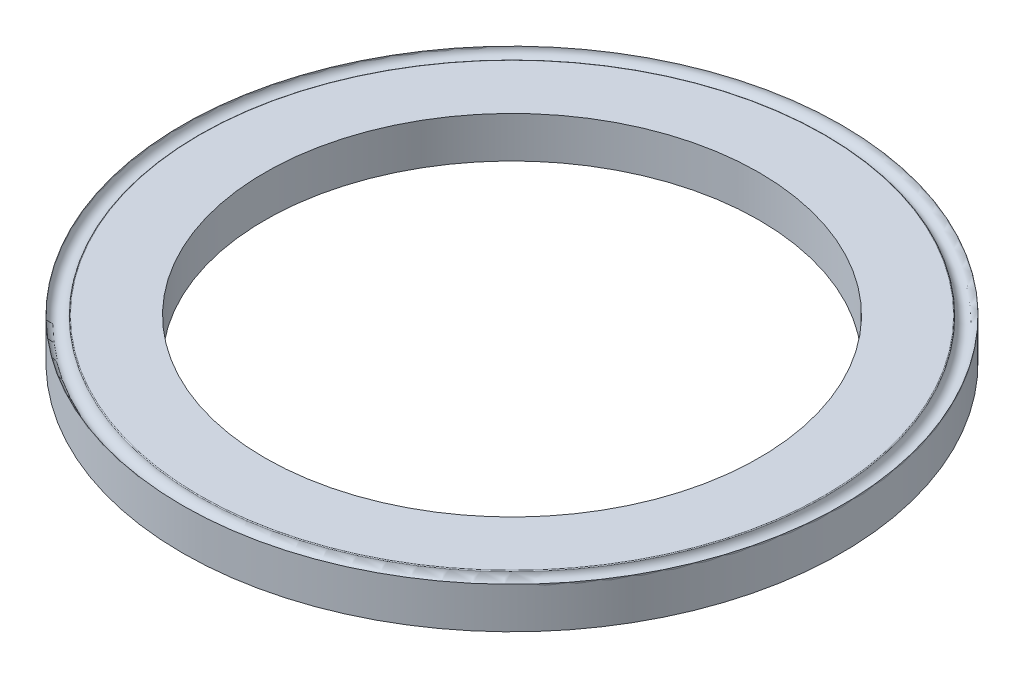
ISO-10303-21;
HEADER;
FILE_DESCRIPTION(('STEP AP214'),'2;1');
FILE_NAME('part.step','',(''),(''),'','','');
FILE_SCHEMA(('AUTOMOTIVE_DESIGN { 1 0 10303 214 1 1 1 1 }'));
ENDSEC;
DATA;
#1=APPLICATION_CONTEXT('core data for automotive mechanical design processes');
#2=APPLICATION_PROTOCOL_DEFINITION('international standard','automotive_design',2000,#1);
#3=PRODUCT_CONTEXT('',#1,'mechanical');
#4=PRODUCT('Part','Part','',(#3));
#5=PRODUCT_RELATED_PRODUCT_CATEGORY('part','',(#4));
#6=PRODUCT_DEFINITION_FORMATION('','',#4);
#7=PRODUCT_DEFINITION_CONTEXT('part definition',#1,'design');
#8=PRODUCT_DEFINITION('design','',#6,#7);
#9=PRODUCT_DEFINITION_SHAPE('','',#8);
#10=(LENGTH_UNIT() NAMED_UNIT(*) SI_UNIT(.MILLI.,.METRE.));
#11=(NAMED_UNIT(*) PLANE_ANGLE_UNIT() SI_UNIT($,.RADIAN.));
#12=(NAMED_UNIT(*) SI_UNIT($,.STERADIAN.) SOLID_ANGLE_UNIT());
#13=UNCERTAINTY_MEASURE_WITH_UNIT(LENGTH_MEASURE(1.E-05),#10,'distance_accuracy_value','');
#14=(GEOMETRIC_REPRESENTATION_CONTEXT(3) GLOBAL_UNCERTAINTY_ASSIGNED_CONTEXT((#13)) GLOBAL_UNIT_ASSIGNED_CONTEXT((#10,
#11,#12)) REPRESENTATION_CONTEXT('',''));
#15=CARTESIAN_POINT('',(0.,0.,0.));
#16=DIRECTION('',(0.,0.,1.));
#17=DIRECTION('',(1.,0.,0.));
#18=AXIS2_PLACEMENT_3D('',#15,#16,#17);
#19=CARTESIAN_POINT('',(0.,0.25,0.));
#20=DIRECTION('',(0.,1.,0.));
#21=DIRECTION('',(0.,0.,1.));
#22=AXIS2_PLACEMENT_3D('',#19,#20,#21);
#23=PLANE('',#22);
#24=CARTESIAN_POINT('',(0.,0.25,0.));
#25=DIRECTION('',(0.,1.,0.));
#26=DIRECTION('',(0.,0.,1.));
#27=AXIS2_PLACEMENT_3D('',#24,#25,#26);
#28=CIRCLE('',#27,3.79045548849897);
#29=CARTESIAN_POINT('',(0.,0.25,3.79045548849897));
#30=VERTEX_POINT('',#29);
#31=EDGE_CURVE('E53',#30,#30,#28,.T.);
#32=ORIENTED_EDGE('',*,*,#31,.T.);
#33=EDGE_LOOP('',(#32));
#34=FACE_BOUND('',#33,.T.);
#35=CARTESIAN_POINT('',(0.,0.25,0.));
#36=DIRECTION('',(0.,1.,0.));
#37=DIRECTION('',(0.,0.,1.));
#38=AXIS2_PLACEMENT_3D('',#35,#36,#37);
#39=CIRCLE('',#38,3.);
#40=CARTESIAN_POINT('',(0.,0.25,3.));
#41=VERTEX_POINT('',#40);
#42=EDGE_CURVE('E37',#41,#41,#39,.T.);
#43=ORIENTED_EDGE('',*,*,#42,.F.);
#44=EDGE_LOOP('',(#43));
#45=FACE_BOUND('',#44,.T.);
#46=ADVANCED_FACE('F30',(#34,#45),#23,.T.);
#47=CARTESIAN_POINT('',(0.,-0.25,0.));
#48=DIRECTION('',(0.,1.,0.));
#49=DIRECTION('',(0.,0.,1.));
#50=AXIS2_PLACEMENT_3D('',#47,#48,#49);
#51=PLANE('',#50);
#52=CARTESIAN_POINT('',(0.,-0.25,0.));
#53=DIRECTION('',(0.,1.,0.));
#54=DIRECTION('',(0.,0.,1.));
#55=AXIS2_PLACEMENT_3D('',#52,#53,#54);
#56=CIRCLE('',#55,4.);
#57=CARTESIAN_POINT('',(0.,-0.25,4.));
#58=VERTEX_POINT('',#57);
#59=EDGE_CURVE('E10',#58,#58,#56,.T.);
#60=ORIENTED_EDGE('',*,*,#59,.F.);
#61=EDGE_LOOP('',(#60));
#62=FACE_BOUND('',#61,.T.);
#63=CARTESIAN_POINT('',(0.,-0.25,0.));
#64=DIRECTION('',(0.,1.,0.));
#65=DIRECTION('',(0.,0.,1.));
#66=AXIS2_PLACEMENT_3D('',#63,#64,#65);
#67=CIRCLE('',#66,3.);
#68=CARTESIAN_POINT('',(0.,-0.25,3.));
#69=VERTEX_POINT('',#68);
#70=EDGE_CURVE('E41',#69,#69,#67,.T.);
#71=ORIENTED_EDGE('',*,*,#70,.T.);
#72=EDGE_LOOP('',(#71));
#73=FACE_BOUND('',#72,.T.);
#74=ADVANCED_FACE('F73',(#62,#73),#51,.F.);
#75=CARTESIAN_POINT('',(0.,0.25,0.));
#76=DIRECTION('',(0.,-1.,0.));
#77=DIRECTION('',(0.,0.,-1.));
#78=AXIS2_PLACEMENT_3D('',#75,#76,#77);
#79=CYLINDRICAL_SURFACE('',#78,4.);
#80=CARTESIAN_POINT('',(0.,0.25,0.));
#81=DIRECTION('',(0.,1.,0.));
#82=DIRECTION('',(0.,0.,1.));
#83=AXIS2_PLACEMENT_3D('',#80,#81,#82);
#84=CIRCLE('',#83,4.);
#85=CARTESIAN_POINT('',(0.,0.25,4.));
#86=VERTEX_POINT('',#85);
#87=EDGE_CURVE('E50',#86,#86,#84,.T.);
#88=ORIENTED_EDGE('',*,*,#87,.F.);
#89=EDGE_LOOP('',(#88));
#90=FACE_BOUND('',#89,.T.);
#91=ORIENTED_EDGE('',*,*,#59,.T.);
#92=EDGE_LOOP('',(#91));
#93=FACE_BOUND('',#92,.T.);
#94=ADVANCED_FACE('F32',(#90,#93),#79,.T.);
#95=CARTESIAN_POINT('',(0.,0.25,0.));
#96=DIRECTION('',(0.,-1.,0.));
#97=DIRECTION('',(0.,0.,-1.));
#98=AXIS2_PLACEMENT_3D('',#95,#96,#97);
#99=CYLINDRICAL_SURFACE('',#98,3.);
#100=ORIENTED_EDGE('',*,*,#42,.T.);
#101=EDGE_LOOP('',(#100));
#102=FACE_BOUND('',#101,.T.);
#103=ORIENTED_EDGE('',*,*,#70,.F.);
#104=EDGE_LOOP('',(#103));
#105=FACE_BOUND('',#104,.T.);
#106=ADVANCED_FACE('F63',(#102,#105),#99,.F.);
#107=CARTESIAN_POINT('',(0.,0.24,0.));
#108=DIRECTION('',(0.,1.,0.));
#109=DIRECTION('',(0.,0.,1.));
#110=AXIS2_PLACEMENT_3D('',#107,#108,#109);
#111=TOROIDAL_SURFACE('',#110,3.79045548849897,0.01);
#112=ORIENTED_EDGE('',*,*,#31,.F.);
#113=EDGE_LOOP('',(#112));
#114=FACE_BOUND('',#113,.T.);
#115=CARTESIAN_POINT('',(0.,0.240909090909091,0.));
#116=DIRECTION('',(0.,1.,0.));
#117=DIRECTION('',(0.,0.,1.));
#118=AXIS2_PLACEMENT_3D('',#115,#116,#117);
#119=CIRCLE('',#118,3.80041408045361);
#120=CARTESIAN_POINT('',(0.,0.240909090909091,3.80041408045361));
#121=VERTEX_POINT('',#120);
#122=EDGE_CURVE('E46',#121,#121,#119,.T.);
#123=ORIENTED_EDGE('',*,*,#122,.T.);
#124=EDGE_LOOP('',(#123));
#125=FACE_BOUND('',#124,.T.);
#126=ADVANCED_FACE('F59',(#114,#125),#111,.T.);
#127=CARTESIAN_POINT('',(0.,0.25,0.));
#128=DIRECTION('',(0.,1.,0.));
#129=DIRECTION('',(0.,0.,1.));
#130=AXIS2_PLACEMENT_3D('',#127,#128,#129);
#131=TOROIDAL_SURFACE('',#130,3.9,0.1);
#132=ORIENTED_EDGE('',*,*,#122,.F.);
#133=EDGE_LOOP('',(#132));
#134=FACE_BOUND('',#133,.T.);
#135=ORIENTED_EDGE('',*,*,#87,.T.);
#136=EDGE_LOOP('',(#135));
#137=FACE_BOUND('',#136,.T.);
#138=ADVANCED_FACE('F62',(#134,#137),#131,.F.);
#139=CLOSED_SHELL('',(#46,#74,#94,#106,#126,#138));
#140=MANIFOLD_SOLID_BREP('B2',#139);
#141=ADVANCED_BREP_SHAPE_REPRESENTATION('',(#18,#140),#14);
#142=SHAPE_DEFINITION_REPRESENTATION(#9,#141);
ENDSEC;
END-ISO-10303-21;
